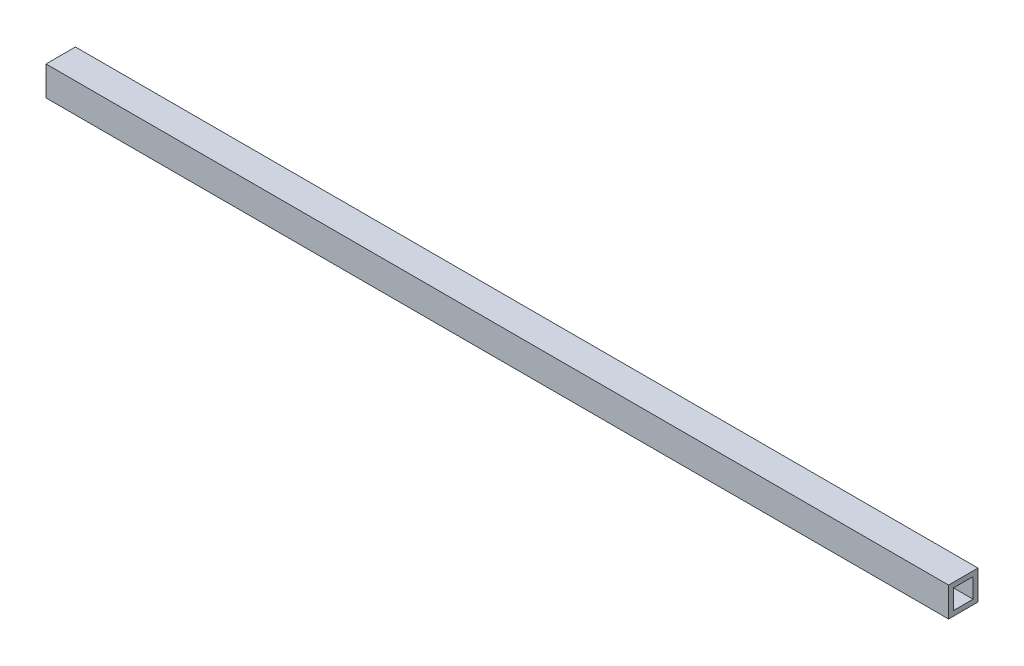
ISO-10303-21;
HEADER;
FILE_DESCRIPTION(('STEP AP214'),'2;1');
FILE_NAME('part.step','',(''),(''),'','','');
FILE_SCHEMA(('AUTOMOTIVE_DESIGN { 1 0 10303 214 1 1 1 1 }'));
ENDSEC;
DATA;
#1=APPLICATION_CONTEXT('core data for automotive mechanical design processes');
#2=APPLICATION_PROTOCOL_DEFINITION('international standard','automotive_design',2000,#1);
#3=PRODUCT_CONTEXT('',#1,'mechanical');
#4=PRODUCT('Part','Part','',(#3));
#5=PRODUCT_RELATED_PRODUCT_CATEGORY('part','',(#4));
#6=PRODUCT_DEFINITION_FORMATION('','',#4);
#7=PRODUCT_DEFINITION_CONTEXT('part definition',#1,'design');
#8=PRODUCT_DEFINITION('design','',#6,#7);
#9=PRODUCT_DEFINITION_SHAPE('','',#8);
#10=(LENGTH_UNIT() NAMED_UNIT(*) SI_UNIT(.MILLI.,.METRE.));
#11=(NAMED_UNIT(*) PLANE_ANGLE_UNIT() SI_UNIT($,.RADIAN.));
#12=(NAMED_UNIT(*) SI_UNIT($,.STERADIAN.) SOLID_ANGLE_UNIT());
#13=UNCERTAINTY_MEASURE_WITH_UNIT(LENGTH_MEASURE(1.E-05),#10,'distance_accuracy_value','');
#14=(GEOMETRIC_REPRESENTATION_CONTEXT(3) GLOBAL_UNCERTAINTY_ASSIGNED_CONTEXT((#13)) GLOBAL_UNIT_ASSIGNED_CONTEXT((#10,
#11,#12)) REPRESENTATION_CONTEXT('',''));
#15=CARTESIAN_POINT('',(0.,0.,0.));
#16=DIRECTION('',(0.,0.,1.));
#17=DIRECTION('',(1.,0.,0.));
#18=AXIS2_PLACEMENT_3D('',#15,#16,#17);
#19=CARTESIAN_POINT('',(584.2,0.,0.));
#20=DIRECTION('',(1.,0.,0.));
#21=DIRECTION('',(0.,0.,-1.));
#22=AXIS2_PLACEMENT_3D('',#19,#20,#21);
#23=PLANE('',#22);
#24=DIRECTION('',(0.,-1.,0.));
#25=VECTOR('',#24,1.);
#26=CARTESIAN_POINT('',(584.2,0.,3.175));
#27=LINE('',#26,#25);
#28=CARTESIAN_POINT('',(584.2,15.875,3.175));
#29=VERTEX_POINT('',#28);
#30=CARTESIAN_POINT('',(584.2,-3.175,3.175));
#31=VERTEX_POINT('',#30);
#32=EDGE_CURVE('E157',#29,#31,#27,.T.);
#33=ORIENTED_EDGE('',*,*,#32,.T.);
#34=DIRECTION('',(0.,0.,-1.));
#35=VECTOR('',#34,1.);
#36=CARTESIAN_POINT('',(584.2,-3.175,0.));
#37=LINE('',#36,#35);
#38=CARTESIAN_POINT('',(584.2,-3.175,-15.875));
#39=VERTEX_POINT('',#38);
#40=EDGE_CURVE('E160',#31,#39,#37,.T.);
#41=ORIENTED_EDGE('',*,*,#40,.T.);
#42=DIRECTION('',(0.,1.,0.));
#43=VECTOR('',#42,1.);
#44=CARTESIAN_POINT('',(584.2,0.,-15.875));
#45=LINE('',#44,#43);
#46=CARTESIAN_POINT('',(584.2,15.875,-15.875));
#47=VERTEX_POINT('',#46);
#48=EDGE_CURVE('E163',#39,#47,#45,.T.);
#49=ORIENTED_EDGE('',*,*,#48,.T.);
#50=DIRECTION('',(0.,0.,1.));
#51=VECTOR('',#50,1.);
#52=CARTESIAN_POINT('',(584.2,15.875,0.));
#53=LINE('',#52,#51);
#54=EDGE_CURVE('E165',#47,#29,#53,.T.);
#55=ORIENTED_EDGE('',*,*,#54,.T.);
#56=EDGE_LOOP('',(#33,#41,#49,#55));
#57=FACE_BOUND('',#56,.T.);
#58=DIRECTION('',(0.,0.,-1.));
#59=VECTOR('',#58,1.);
#60=CARTESIAN_POINT('',(584.2,0.,0.));
#61=LINE('',#60,#59);
#62=CARTESIAN_POINT('',(584.2,0.,0.));
#63=VERTEX_POINT('',#62);
#64=CARTESIAN_POINT('',(584.2,0.,-12.7));
#65=VERTEX_POINT('',#64);
#66=EDGE_CURVE('E129',#63,#65,#61,.T.);
#67=ORIENTED_EDGE('',*,*,#66,.F.);
#68=DIRECTION('',(0.,-1.,0.));
#69=VECTOR('',#68,1.);
#70=CARTESIAN_POINT('',(584.2,0.,0.));
#71=LINE('',#70,#69);
#72=CARTESIAN_POINT('',(584.2,12.7,0.));
#73=VERTEX_POINT('',#72);
#74=EDGE_CURVE('E121',#73,#63,#71,.T.);
#75=ORIENTED_EDGE('',*,*,#74,.F.);
#76=DIRECTION('',(0.,0.,1.));
#77=VECTOR('',#76,1.);
#78=CARTESIAN_POINT('',(584.2,12.7,0.));
#79=LINE('',#78,#77);
#80=CARTESIAN_POINT('',(584.2,12.7,-12.7));
#81=VERTEX_POINT('',#80);
#82=EDGE_CURVE('E143',#81,#73,#79,.T.);
#83=ORIENTED_EDGE('',*,*,#82,.F.);
#84=DIRECTION('',(0.,1.,0.));
#85=VECTOR('',#84,1.);
#86=CARTESIAN_POINT('',(584.2,0.,-12.7));
#87=LINE('',#86,#85);
#88=EDGE_CURVE('E141',#65,#81,#87,.T.);
#89=ORIENTED_EDGE('',*,*,#88,.F.);
#90=EDGE_LOOP('',(#67,#75,#83,#89));
#91=FACE_BOUND('',#90,.T.);
#92=ADVANCED_FACE('F56',(#57,#91),#23,.T.);
#93=CARTESIAN_POINT('',(0.,0.,0.));
#94=DIRECTION('',(1.,0.,0.));
#95=DIRECTION('',(0.,0.,-1.));
#96=AXIS2_PLACEMENT_3D('',#93,#94,#95);
#97=PLANE('',#96);
#98=DIRECTION('',(0.,-1.,0.));
#99=VECTOR('',#98,1.);
#100=CARTESIAN_POINT('',(0.,0.,3.175));
#101=LINE('',#100,#99);
#102=CARTESIAN_POINT('',(0.,15.875,3.175));
#103=VERTEX_POINT('',#102);
#104=CARTESIAN_POINT('',(0.,-3.175,3.175));
#105=VERTEX_POINT('',#104);
#106=EDGE_CURVE('E137',#103,#105,#101,.T.);
#107=ORIENTED_EDGE('',*,*,#106,.F.);
#108=DIRECTION('',(0.,0.,1.));
#109=VECTOR('',#108,1.);
#110=CARTESIAN_POINT('',(0.,15.875,0.));
#111=LINE('',#110,#109);
#112=CARTESIAN_POINT('',(0.,15.875,-15.875));
#113=VERTEX_POINT('',#112);
#114=EDGE_CURVE('E161',#113,#103,#111,.T.);
#115=ORIENTED_EDGE('',*,*,#114,.F.);
#116=DIRECTION('',(0.,1.,0.));
#117=VECTOR('',#116,1.);
#118=CARTESIAN_POINT('',(0.,0.,-15.875));
#119=LINE('',#118,#117);
#120=CARTESIAN_POINT('',(0.,-3.175,-15.875));
#121=VERTEX_POINT('',#120);
#122=EDGE_CURVE('E172',#121,#113,#119,.T.);
#123=ORIENTED_EDGE('',*,*,#122,.F.);
#124=DIRECTION('',(0.,0.,-1.));
#125=VECTOR('',#124,1.);
#126=CARTESIAN_POINT('',(0.,-3.175,0.));
#127=LINE('',#126,#125);
#128=EDGE_CURVE('E170',#105,#121,#127,.T.);
#129=ORIENTED_EDGE('',*,*,#128,.F.);
#130=EDGE_LOOP('',(#107,#115,#123,#129));
#131=FACE_BOUND('',#130,.T.);
#132=DIRECTION('',(0.,-1.,0.));
#133=VECTOR('',#132,1.);
#134=CARTESIAN_POINT('',(0.,0.,0.));
#135=LINE('',#134,#133);
#136=CARTESIAN_POINT('',(0.,12.7,0.));
#137=VERTEX_POINT('',#136);
#138=CARTESIAN_POINT('',(0.,0.,0.));
#139=VERTEX_POINT('',#138);
#140=EDGE_CURVE('E79',#137,#139,#135,.T.);
#141=ORIENTED_EDGE('',*,*,#140,.T.);
#142=DIRECTION('',(0.,0.,-1.));
#143=VECTOR('',#142,1.);
#144=CARTESIAN_POINT('',(0.,0.,0.));
#145=LINE('',#144,#143);
#146=CARTESIAN_POINT('',(0.,0.,-12.7));
#147=VERTEX_POINT('',#146);
#148=EDGE_CURVE('E136',#139,#147,#145,.T.);
#149=ORIENTED_EDGE('',*,*,#148,.T.);
#150=DIRECTION('',(0.,1.,0.));
#151=VECTOR('',#150,1.);
#152=CARTESIAN_POINT('',(0.,0.,-12.7));
#153=LINE('',#152,#151);
#154=CARTESIAN_POINT('',(0.,12.7,-12.7));
#155=VERTEX_POINT('',#154);
#156=EDGE_CURVE('E149',#147,#155,#153,.T.);
#157=ORIENTED_EDGE('',*,*,#156,.T.);
#158=DIRECTION('',(0.,0.,1.));
#159=VECTOR('',#158,1.);
#160=CARTESIAN_POINT('',(0.,12.7,0.));
#161=LINE('',#160,#159);
#162=EDGE_CURVE('E130',#155,#137,#161,.T.);
#163=ORIENTED_EDGE('',*,*,#162,.T.);
#164=EDGE_LOOP('',(#141,#149,#157,#163));
#165=FACE_BOUND('',#164,.T.);
#166=ADVANCED_FACE('F190',(#131,#165),#97,.F.);
#167=CARTESIAN_POINT('',(584.2,0.,3.175));
#168=DIRECTION('',(0.,0.,-1.));
#169=DIRECTION('',(-1.,0.,0.));
#170=AXIS2_PLACEMENT_3D('',#167,#168,#169);
#171=PLANE('',#170);
#172=ORIENTED_EDGE('',*,*,#106,.T.);
#173=DIRECTION('',(-1.,0.,0.));
#174=VECTOR('',#173,1.);
#175=CARTESIAN_POINT('',(584.2,-3.175,3.175));
#176=LINE('',#175,#174);
#177=EDGE_CURVE('E12',#31,#105,#176,.T.);
#178=ORIENTED_EDGE('',*,*,#177,.F.);
#179=ORIENTED_EDGE('',*,*,#32,.F.);
#180=DIRECTION('',(-1.,0.,0.));
#181=VECTOR('',#180,1.);
#182=CARTESIAN_POINT('',(584.2,15.875,3.175));
#183=LINE('',#182,#181);
#184=EDGE_CURVE('E167',#29,#103,#183,.T.);
#185=ORIENTED_EDGE('',*,*,#184,.T.);
#186=EDGE_LOOP('',(#172,#178,#179,#185));
#187=FACE_BOUND('',#186,.T.);
#188=ADVANCED_FACE('F58',(#187),#171,.F.);
#189=CARTESIAN_POINT('',(584.2,-3.175,0.));
#190=DIRECTION('',(0.,1.,0.));
#191=DIRECTION('',(0.,0.,1.));
#192=AXIS2_PLACEMENT_3D('',#189,#190,#191);
#193=PLANE('',#192);
#194=ORIENTED_EDGE('',*,*,#128,.T.);
#195=DIRECTION('',(-1.,0.,0.));
#196=VECTOR('',#195,1.);
#197=CARTESIAN_POINT('',(584.2,-3.175,-15.875));
#198=LINE('',#197,#196);
#199=EDGE_CURVE('E64',#39,#121,#198,.T.);
#200=ORIENTED_EDGE('',*,*,#199,.F.);
#201=ORIENTED_EDGE('',*,*,#40,.F.);
#202=ORIENTED_EDGE('',*,*,#177,.T.);
#203=EDGE_LOOP('',(#194,#200,#201,#202));
#204=FACE_BOUND('',#203,.T.);
#205=ADVANCED_FACE('F200',(#204),#193,.F.);
#206=CARTESIAN_POINT('',(584.2,0.,-15.875));
#207=DIRECTION('',(0.,0.,1.));
#208=DIRECTION('',(1.,0.,0.));
#209=AXIS2_PLACEMENT_3D('',#206,#207,#208);
#210=PLANE('',#209);
#211=ORIENTED_EDGE('',*,*,#122,.T.);
#212=DIRECTION('',(-1.,0.,0.));
#213=VECTOR('',#212,1.);
#214=CARTESIAN_POINT('',(584.2,15.875,-15.875));
#215=LINE('',#214,#213);
#216=EDGE_CURVE('E177',#47,#113,#215,.T.);
#217=ORIENTED_EDGE('',*,*,#216,.F.);
#218=ORIENTED_EDGE('',*,*,#48,.F.);
#219=ORIENTED_EDGE('',*,*,#199,.T.);
#220=EDGE_LOOP('',(#211,#217,#218,#219));
#221=FACE_BOUND('',#220,.T.);
#222=ADVANCED_FACE('F184',(#221),#210,.F.);
#223=CARTESIAN_POINT('',(584.2,15.875,0.));
#224=DIRECTION('',(0.,-1.,0.));
#225=DIRECTION('',(0.,0.,-1.));
#226=AXIS2_PLACEMENT_3D('',#223,#224,#225);
#227=PLANE('',#226);
#228=ORIENTED_EDGE('',*,*,#114,.T.);
#229=ORIENTED_EDGE('',*,*,#184,.F.);
#230=ORIENTED_EDGE('',*,*,#54,.F.);
#231=ORIENTED_EDGE('',*,*,#216,.T.);
#232=EDGE_LOOP('',(#228,#229,#230,#231));
#233=FACE_BOUND('',#232,.T.);
#234=ADVANCED_FACE('F194',(#233),#227,.F.);
#235=CARTESIAN_POINT('',(584.2,0.,0.));
#236=DIRECTION('',(0.,0.,-1.));
#237=DIRECTION('',(-1.,0.,0.));
#238=AXIS2_PLACEMENT_3D('',#235,#236,#237);
#239=PLANE('',#238);
#240=ORIENTED_EDGE('',*,*,#140,.F.);
#241=DIRECTION('',(-1.,0.,0.));
#242=VECTOR('',#241,1.);
#243=CARTESIAN_POINT('',(584.2,12.7,0.));
#244=LINE('',#243,#242);
#245=EDGE_CURVE('E125',#73,#137,#244,.T.);
#246=ORIENTED_EDGE('',*,*,#245,.F.);
#247=ORIENTED_EDGE('',*,*,#74,.T.);
#248=DIRECTION('',(-1.,0.,0.));
#249=VECTOR('',#248,1.);
#250=CARTESIAN_POINT('',(584.2,0.,0.));
#251=LINE('',#250,#249);
#252=EDGE_CURVE('E124',#63,#139,#251,.T.);
#253=ORIENTED_EDGE('',*,*,#252,.T.);
#254=EDGE_LOOP('',(#240,#246,#247,#253));
#255=FACE_BOUND('',#254,.T.);
#256=ADVANCED_FACE('F123',(#255),#239,.T.);
#257=CARTESIAN_POINT('',(584.2,0.,0.));
#258=DIRECTION('',(0.,1.,0.));
#259=DIRECTION('',(0.,0.,1.));
#260=AXIS2_PLACEMENT_3D('',#257,#258,#259);
#261=PLANE('',#260);
#262=ORIENTED_EDGE('',*,*,#148,.F.);
#263=ORIENTED_EDGE('',*,*,#252,.F.);
#264=ORIENTED_EDGE('',*,*,#66,.T.);
#265=DIRECTION('',(-1.,0.,0.));
#266=VECTOR('',#265,1.);
#267=CARTESIAN_POINT('',(584.2,0.,-12.7));
#268=LINE('',#267,#266);
#269=EDGE_CURVE('E138',#65,#147,#268,.T.);
#270=ORIENTED_EDGE('',*,*,#269,.T.);
#271=EDGE_LOOP('',(#262,#263,#264,#270));
#272=FACE_BOUND('',#271,.T.);
#273=ADVANCED_FACE('F133',(#272),#261,.T.);
#274=CARTESIAN_POINT('',(584.2,0.,-12.7));
#275=DIRECTION('',(0.,0.,1.));
#276=DIRECTION('',(1.,0.,0.));
#277=AXIS2_PLACEMENT_3D('',#274,#275,#276);
#278=PLANE('',#277);
#279=ORIENTED_EDGE('',*,*,#156,.F.);
#280=ORIENTED_EDGE('',*,*,#269,.F.);
#281=ORIENTED_EDGE('',*,*,#88,.T.);
#282=DIRECTION('',(-1.,0.,0.));
#283=VECTOR('',#282,1.);
#284=CARTESIAN_POINT('',(584.2,12.7,-12.7));
#285=LINE('',#284,#283);
#286=EDGE_CURVE('E71',#81,#155,#285,.T.);
#287=ORIENTED_EDGE('',*,*,#286,.T.);
#288=EDGE_LOOP('',(#279,#280,#281,#287));
#289=FACE_BOUND('',#288,.T.);
#290=ADVANCED_FACE('F223',(#289),#278,.T.);
#291=CARTESIAN_POINT('',(584.2,12.7,0.));
#292=DIRECTION('',(0.,-1.,0.));
#293=DIRECTION('',(0.,0.,-1.));
#294=AXIS2_PLACEMENT_3D('',#291,#292,#293);
#295=PLANE('',#294);
#296=ORIENTED_EDGE('',*,*,#162,.F.);
#297=ORIENTED_EDGE('',*,*,#286,.F.);
#298=ORIENTED_EDGE('',*,*,#82,.T.);
#299=ORIENTED_EDGE('',*,*,#245,.T.);
#300=EDGE_LOOP('',(#296,#297,#298,#299));
#301=FACE_BOUND('',#300,.T.);
#302=ADVANCED_FACE('F227',(#301),#295,.T.);
#303=CLOSED_SHELL('',(#92,#166,#188,#205,#222,#234,#256,#273,#290,#302));
#304=MANIFOLD_SOLID_BREP('B2',#303);
#305=ADVANCED_BREP_SHAPE_REPRESENTATION('',(#18,#304),#14);
#306=SHAPE_DEFINITION_REPRESENTATION(#9,#305);
ENDSEC;
END-ISO-10303-21;
